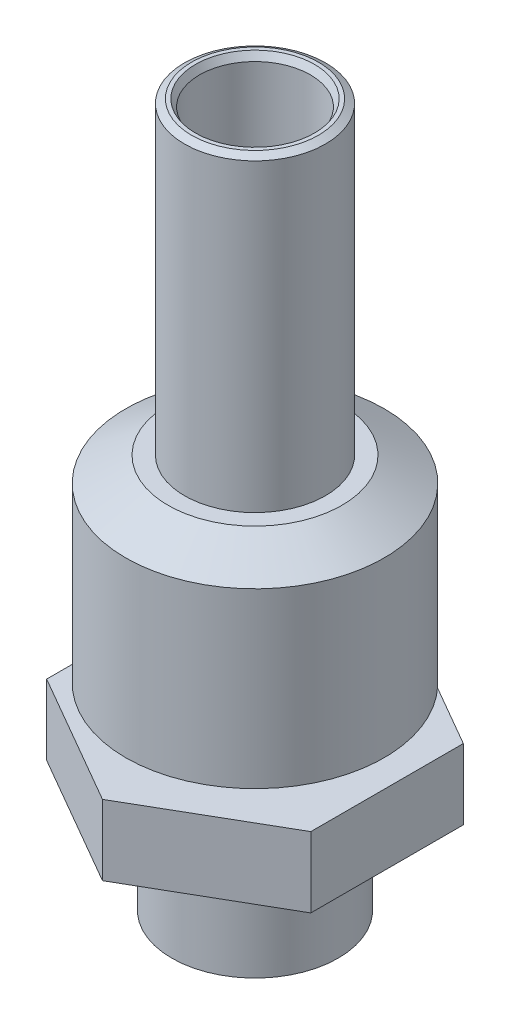
ISO-10303-21;
HEADER;
FILE_DESCRIPTION(('STEP AP214'),'2;1');
FILE_NAME('part.step','',(''),(''),'','','');
FILE_SCHEMA(('AUTOMOTIVE_DESIGN { 1 0 10303 214 1 1 1 1 }'));
ENDSEC;
DATA;
#1=APPLICATION_CONTEXT('core data for automotive mechanical design processes');
#2=APPLICATION_PROTOCOL_DEFINITION('international standard','automotive_design',2000,#1);
#3=PRODUCT_CONTEXT('',#1,'mechanical');
#4=PRODUCT('Part','Part','',(#3));
#5=PRODUCT_RELATED_PRODUCT_CATEGORY('part','',(#4));
#6=PRODUCT_DEFINITION_FORMATION('','',#4);
#7=PRODUCT_DEFINITION_CONTEXT('part definition',#1,'design');
#8=PRODUCT_DEFINITION('design','',#6,#7);
#9=PRODUCT_DEFINITION_SHAPE('','',#8);
#10=(LENGTH_UNIT() NAMED_UNIT(*) SI_UNIT(.MILLI.,.METRE.));
#11=(NAMED_UNIT(*) PLANE_ANGLE_UNIT() SI_UNIT($,.RADIAN.));
#12=(NAMED_UNIT(*) SI_UNIT($,.STERADIAN.) SOLID_ANGLE_UNIT());
#13=UNCERTAINTY_MEASURE_WITH_UNIT(LENGTH_MEASURE(1.E-05),#10,'distance_accuracy_value','');
#14=(GEOMETRIC_REPRESENTATION_CONTEXT(3) GLOBAL_UNCERTAINTY_ASSIGNED_CONTEXT((#13)) GLOBAL_UNIT_ASSIGNED_CONTEXT((#10,
#11,#12)) REPRESENTATION_CONTEXT('',''));
#15=CARTESIAN_POINT('',(0.,0.,0.));
#16=DIRECTION('',(0.,0.,1.));
#17=DIRECTION('',(1.,0.,0.));
#18=AXIS2_PLACEMENT_3D('',#15,#16,#17);
#19=CARTESIAN_POINT('',(4.7625,27.432,2.74963065701559));
#20=DIRECTION('',(-1.,0.,0.));
#21=DIRECTION('',(0.,0.,1.));
#22=AXIS2_PLACEMENT_3D('',#19,#20,#21);
#23=PLANE('',#22);
#24=DIRECTION('',(0.,0.,1.));
#25=VECTOR('',#24,1.);
#26=CARTESIAN_POINT('',(4.7625,5.762,2.74963065701559));
#27=LINE('',#26,#25);
#28=CARTESIAN_POINT('',(4.7625,5.762,-2.74963065701559));
#29=VERTEX_POINT('',#28);
#30=CARTESIAN_POINT('',(4.7625,5.762,2.74963065701559));
#31=VERTEX_POINT('',#30);
#32=EDGE_CURVE('E51',#29,#31,#27,.T.);
#33=ORIENTED_EDGE('',*,*,#32,.F.);
#34=DIRECTION('',(0.,-1.,0.));
#35=VECTOR('',#34,1.);
#36=CARTESIAN_POINT('',(4.7625,27.432,-2.74963065701559));
#37=LINE('',#36,#35);
#38=CARTESIAN_POINT('',(4.7625,8.302,-2.74963065701559));
#39=VERTEX_POINT('',#38);
#40=EDGE_CURVE('E119',#39,#29,#37,.T.);
#41=ORIENTED_EDGE('',*,*,#40,.F.);
#42=DIRECTION('',(0.,0.,1.));
#43=VECTOR('',#42,1.);
#44=CARTESIAN_POINT('',(4.7625,8.302,2.74963065701559));
#45=LINE('',#44,#43);
#46=CARTESIAN_POINT('',(4.7625,8.302,2.74963065701559));
#47=VERTEX_POINT('',#46);
#48=EDGE_CURVE('E110',#39,#47,#45,.T.);
#49=ORIENTED_EDGE('',*,*,#48,.T.);
#50=DIRECTION('',(0.,-1.,0.));
#51=VECTOR('',#50,1.);
#52=CARTESIAN_POINT('',(4.7625,27.432,2.74963065701559));
#53=LINE('',#52,#51);
#54=EDGE_CURVE('E106',#47,#31,#53,.T.);
#55=ORIENTED_EDGE('',*,*,#54,.T.);
#56=EDGE_LOOP('',(#33,#41,#49,#55));
#57=FACE_BOUND('',#56,.T.);
#58=ADVANCED_FACE('F37',(#57),#23,.F.);
#59=CARTESIAN_POINT('',(4.7625,27.432,-2.74963065701559));
#60=DIRECTION('',(-0.5,0.,0.866025403784439));
#61=DIRECTION('',(0.866025403784439,0.,0.5));
#62=AXIS2_PLACEMENT_3D('',#59,#60,#61);
#63=PLANE('',#62);
#64=DIRECTION('',(0.866025403784439,0.,0.5));
#65=VECTOR('',#64,1.);
#66=CARTESIAN_POINT('',(4.76249999999999,5.762,-2.7496306570156));
#67=LINE('',#66,#65);
#68=CARTESIAN_POINT('',(0.,5.762,-5.49926131403118));
#69=VERTEX_POINT('',#68);
#70=EDGE_CURVE('E154',#69,#29,#67,.T.);
#71=ORIENTED_EDGE('',*,*,#70,.F.);
#72=DIRECTION('',(0.,-1.,0.));
#73=VECTOR('',#72,1.);
#74=CARTESIAN_POINT('',(0.,27.432,-5.49926131403118));
#75=LINE('',#74,#73);
#76=CARTESIAN_POINT('',(0.,8.302,-5.49926131403118));
#77=VERTEX_POINT('',#76);
#78=EDGE_CURVE('E116',#77,#69,#75,.T.);
#79=ORIENTED_EDGE('',*,*,#78,.F.);
#80=DIRECTION('',(0.866025403784439,0.,0.5));
#81=VECTOR('',#80,1.);
#82=CARTESIAN_POINT('',(4.7625,8.302,-2.74963065701559));
#83=LINE('',#82,#81);
#84=EDGE_CURVE('E189',#77,#39,#83,.T.);
#85=ORIENTED_EDGE('',*,*,#84,.T.);
#86=ORIENTED_EDGE('',*,*,#40,.T.);
#87=EDGE_LOOP('',(#71,#79,#85,#86));
#88=FACE_BOUND('',#87,.T.);
#89=ADVANCED_FACE('F198',(#88),#63,.F.);
#90=CARTESIAN_POINT('',(0.,27.432,-5.49926131403118));
#91=DIRECTION('',(0.500000000000001,0.,0.866025403784438));
#92=DIRECTION('',(0.866025403784438,0.,-0.500000000000001));
#93=AXIS2_PLACEMENT_3D('',#90,#91,#92);
#94=PLANE('',#93);
#95=DIRECTION('',(0.866025403784438,0.,-0.500000000000001));
#96=VECTOR('',#95,1.);
#97=CARTESIAN_POINT('',(0.,5.762,-5.49926131403118));
#98=LINE('',#97,#96);
#99=CARTESIAN_POINT('',(-4.7625,5.762,-2.74963065701559));
#100=VERTEX_POINT('',#99);
#101=EDGE_CURVE('E152',#100,#69,#98,.T.);
#102=ORIENTED_EDGE('',*,*,#101,.F.);
#103=DIRECTION('',(0.,-1.,0.));
#104=VECTOR('',#103,1.);
#105=CARTESIAN_POINT('',(-4.7625,27.432,-2.74963065701559));
#106=LINE('',#105,#104);
#107=CARTESIAN_POINT('',(-4.7625,8.302,-2.74963065701559));
#108=VERTEX_POINT('',#107);
#109=EDGE_CURVE('E108',#108,#100,#106,.T.);
#110=ORIENTED_EDGE('',*,*,#109,.F.);
#111=DIRECTION('',(0.866025403784438,0.,-0.500000000000001));
#112=VECTOR('',#111,1.);
#113=CARTESIAN_POINT('',(0.,8.302,-5.49926131403118));
#114=LINE('',#113,#112);
#115=EDGE_CURVE('E186',#108,#77,#114,.T.);
#116=ORIENTED_EDGE('',*,*,#115,.T.);
#117=ORIENTED_EDGE('',*,*,#78,.T.);
#118=EDGE_LOOP('',(#102,#110,#116,#117));
#119=FACE_BOUND('',#118,.T.);
#120=ADVANCED_FACE('F201',(#119),#94,.F.);
#121=CARTESIAN_POINT('',(-4.7625,27.432,-2.74963065701559));
#122=DIRECTION('',(1.,0.,0.));
#123=DIRECTION('',(0.,0.,-1.));
#124=AXIS2_PLACEMENT_3D('',#121,#122,#123);
#125=PLANE('',#124);
#126=DIRECTION('',(0.,0.,-1.));
#127=VECTOR('',#126,1.);
#128=CARTESIAN_POINT('',(-4.7625,5.762,-2.74963065701559));
#129=LINE('',#128,#127);
#130=CARTESIAN_POINT('',(-4.7625,5.762,2.7496306570156));
#131=VERTEX_POINT('',#130);
#132=EDGE_CURVE('E101',#131,#100,#129,.T.);
#133=ORIENTED_EDGE('',*,*,#132,.F.);
#134=DIRECTION('',(0.,-1.,0.));
#135=VECTOR('',#134,1.);
#136=CARTESIAN_POINT('',(-4.7625,27.432,2.7496306570156));
#137=LINE('',#136,#135);
#138=CARTESIAN_POINT('',(-4.7625,8.302,2.7496306570156));
#139=VERTEX_POINT('',#138);
#140=EDGE_CURVE('E100',#139,#131,#137,.T.);
#141=ORIENTED_EDGE('',*,*,#140,.F.);
#142=DIRECTION('',(0.,0.,-1.));
#143=VECTOR('',#142,1.);
#144=CARTESIAN_POINT('',(-4.7625,8.302,-2.74963065701559));
#145=LINE('',#144,#143);
#146=EDGE_CURVE('E183',#139,#108,#145,.T.);
#147=ORIENTED_EDGE('',*,*,#146,.T.);
#148=ORIENTED_EDGE('',*,*,#109,.T.);
#149=EDGE_LOOP('',(#133,#141,#147,#148));
#150=FACE_BOUND('',#149,.T.);
#151=ADVANCED_FACE('F204',(#150),#125,.F.);
#152=CARTESIAN_POINT('',(-4.7625,27.432,2.7496306570156));
#153=DIRECTION('',(0.5,0.,-0.866025403784439));
#154=DIRECTION('',(-0.866025403784439,0.,-0.5));
#155=AXIS2_PLACEMENT_3D('',#152,#153,#154);
#156=PLANE('',#155);
#157=DIRECTION('',(-0.866025403784439,0.,-0.5));
#158=VECTOR('',#157,1.);
#159=CARTESIAN_POINT('',(-4.7625,5.762,2.74963065701559));
#160=LINE('',#159,#158);
#161=CARTESIAN_POINT('',(0.,5.762,5.49926131403119));
#162=VERTEX_POINT('',#161);
#163=EDGE_CURVE('E88',#162,#131,#160,.T.);
#164=ORIENTED_EDGE('',*,*,#163,.F.);
#165=DIRECTION('',(0.,-1.,0.));
#166=VECTOR('',#165,1.);
#167=CARTESIAN_POINT('',(0.,27.432,5.49926131403119));
#168=LINE('',#167,#166);
#169=CARTESIAN_POINT('',(0.,8.302,5.49926131403119));
#170=VERTEX_POINT('',#169);
#171=EDGE_CURVE('E98',#170,#162,#168,.T.);
#172=ORIENTED_EDGE('',*,*,#171,.F.);
#173=DIRECTION('',(-0.866025403784439,0.,-0.5));
#174=VECTOR('',#173,1.);
#175=CARTESIAN_POINT('',(-4.7625,8.302,2.7496306570156));
#176=LINE('',#175,#174);
#177=EDGE_CURVE('E59',#170,#139,#176,.T.);
#178=ORIENTED_EDGE('',*,*,#177,.T.);
#179=ORIENTED_EDGE('',*,*,#140,.T.);
#180=EDGE_LOOP('',(#164,#172,#178,#179));
#181=FACE_BOUND('',#180,.T.);
#182=ADVANCED_FACE('F97',(#181),#156,.F.);
#183=CARTESIAN_POINT('',(0.,27.432,5.49926131403119));
#184=DIRECTION('',(-0.5,0.,-0.866025403784438));
#185=DIRECTION('',(-0.866025403784438,0.,0.5));
#186=AXIS2_PLACEMENT_3D('',#183,#184,#185);
#187=PLANE('',#186);
#188=DIRECTION('',(-0.866025403784438,0.,0.5));
#189=VECTOR('',#188,1.);
#190=CARTESIAN_POINT('',(0.,5.762,5.49926131403119));
#191=LINE('',#190,#189);
#192=EDGE_CURVE('E11',#31,#162,#191,.T.);
#193=ORIENTED_EDGE('',*,*,#192,.F.);
#194=ORIENTED_EDGE('',*,*,#54,.F.);
#195=DIRECTION('',(-0.866025403784438,0.,0.5));
#196=VECTOR('',#195,1.);
#197=CARTESIAN_POINT('',(0.,8.302,5.49926131403119));
#198=LINE('',#197,#196);
#199=EDGE_CURVE('E105',#47,#170,#198,.T.);
#200=ORIENTED_EDGE('',*,*,#199,.T.);
#201=ORIENTED_EDGE('',*,*,#171,.T.);
#202=EDGE_LOOP('',(#193,#194,#200,#201));
#203=FACE_BOUND('',#202,.T.);
#204=ADVANCED_FACE('F104',(#203),#187,.F.);
#205=CARTESIAN_POINT('',(0.,1.39107264208463,0.));
#206=DIRECTION('',(0.,1.,0.));
#207=DIRECTION('',(0.,0.,1.));
#208=AXIS2_PLACEMENT_3D('',#205,#206,#207);
#209=CONICAL_SURFACE('',#208,0.,1.08210413623648);
#210=CARTESIAN_POINT('',(0.,1.92116035997955,0.));
#211=DIRECTION('',(0.,-1.,0.));
#212=DIRECTION('',(0.,0.,-1.));
#213=AXIS2_PLACEMENT_3D('',#210,#211,#212);
#214=CIRCLE('',#213,0.996949999999998);
#215=CARTESIAN_POINT('',(0.,1.92116035997955,0.996949999999998));
#216=VERTEX_POINT('',#215);
#217=EDGE_CURVE('E158',#216,#216,#214,.T.);
#218=CARTESIAN_POINT('',(0.,1.48412179262539,0.));
#219=DIRECTION('',(0.,1.,0.));
#220=DIRECTION('',(0.,0.,1.));
#221=AXIS2_PLACEMENT_3D('',#218,#219,#220);
#222=CIRCLE('',#221,0.175);
#223=CARTESIAN_POINT('',(0.,1.48412179262539,0.175));
#224=VERTEX_POINT('',#223);
#225=EDGE_CURVE('E102',#224,#224,#222,.T.);
#226=CARTESIAN_POINT('',(0.,1.92116035997955,0.996949999999998));
#227=CARTESIAN_POINT('',(0.,1.91660787490294,0.988388020833332));
#228=CARTESIAN_POINT('',(0.,1.91205538982634,0.979826041666665));
#229=CARTESIAN_POINT('',(0.,1.90295041967312,0.962702083333332));
#230=CARTESIAN_POINT('',(0.,1.89839793459652,0.954140104166665));
#231=CARTESIAN_POINT('',(0.,1.88929296444331,0.937016145833332));
#232=CARTESIAN_POINT('',(0.,1.8847404793667,0.928454166666665));
#233=CARTESIAN_POINT('',(0.,1.87563550921349,0.911330208333332));
#234=CARTESIAN_POINT('',(0.,1.87108302413688,0.902768229166665));
#235=CARTESIAN_POINT('',(0.,1.86197805398367,0.885644270833332));
#236=CARTESIAN_POINT('',(0.,1.85742556890707,0.877082291666665));
#237=CARTESIAN_POINT('',(0.,1.84832059875385,0.859958333333332));
#238=CARTESIAN_POINT('',(0.,1.84376811367725,0.851396354166665));
#239=CARTESIAN_POINT('',(0.,1.83466314352404,0.834272395833332));
#240=CARTESIAN_POINT('',(0.,1.83011065844743,0.825710416666665));
#241=CARTESIAN_POINT('',(0.,1.82100568829422,0.808586458333332));
#242=CARTESIAN_POINT('',(0.,1.81645320321761,0.800024479166665));
#243=CARTESIAN_POINT('',(0.,1.8073482330644,0.782900520833332));
#244=CARTESIAN_POINT('',(0.,1.8027957479878,0.774338541666665));
#245=CARTESIAN_POINT('',(0.,1.79369077783458,0.757214583333332));
#246=CARTESIAN_POINT('',(0.,1.78913829275798,0.748652604166666));
#247=CARTESIAN_POINT('',(0.,1.78003332260477,0.731528645833332));
#248=CARTESIAN_POINT('',(0.,1.77548083752816,0.722966666666666));
#249=CARTESIAN_POINT('',(0.,1.76637586737495,0.705842708333332));
#250=CARTESIAN_POINT('',(0.,1.76182338229834,0.697280729166666));
#251=CARTESIAN_POINT('',(0.,1.75271841214513,0.680156770833332));
#252=CARTESIAN_POINT('',(0.,1.74816592706853,0.671594791666666));
#253=CARTESIAN_POINT('',(0.,1.73906095691532,0.654470833333332));
#254=CARTESIAN_POINT('',(0.,1.73450847183871,0.645908854166666));
#255=CARTESIAN_POINT('',(0.,1.7254035016855,0.628784895833332));
#256=CARTESIAN_POINT('',(0.,1.72085101660889,0.620222916666666));
#257=CARTESIAN_POINT('',(0.,1.71174604645568,0.603098958333332));
#258=CARTESIAN_POINT('',(0.,1.70719356137907,0.594536979166666));
#259=CARTESIAN_POINT('',(0.,1.69808859122586,0.577413020833332));
#260=CARTESIAN_POINT('',(0.,1.69353610614926,0.568851041666666));
#261=CARTESIAN_POINT('',(0.,1.68443113599605,0.551727083333333));
#262=CARTESIAN_POINT('',(0.,1.67987865091944,0.543165104166666));
#263=CARTESIAN_POINT('',(0.,1.67077368076623,0.526041145833333));
#264=CARTESIAN_POINT('',(0.,1.66622119568962,0.517479166666666));
#265=CARTESIAN_POINT('',(0.,1.65711622553641,0.500355208333333));
#266=CARTESIAN_POINT('',(0.,1.65256374045981,0.491793229166666));
#267=CARTESIAN_POINT('',(0.,1.64345877030659,0.474669270833333));
#268=CARTESIAN_POINT('',(0.,1.63890628522999,0.466107291666666));
#269=CARTESIAN_POINT('',(0.,1.62980131507678,0.448983333333333));
#270=CARTESIAN_POINT('',(0.,1.62524883000017,0.440421354166666));
#271=CARTESIAN_POINT('',(0.,1.61614385984696,0.423297395833333));
#272=CARTESIAN_POINT('',(0.,1.61159137477035,0.414735416666666));
#273=CARTESIAN_POINT('',(0.,1.60248640461714,0.397611458333333));
#274=CARTESIAN_POINT('',(0.,1.59793391954054,0.389049479166666));
#275=CARTESIAN_POINT('',(0.,1.58882894938732,0.371925520833333));
#276=CARTESIAN_POINT('',(0.,1.58427646431072,0.363363541666666));
#277=CARTESIAN_POINT('',(0.,1.57517149415751,0.346239583333333));
#278=CARTESIAN_POINT('',(0.,1.5706190090809,0.337677604166666));
#279=CARTESIAN_POINT('',(0.,1.56151403892769,0.320553645833333));
#280=CARTESIAN_POINT('',(0.,1.55696155385108,0.311991666666666));
#281=CARTESIAN_POINT('',(0.,1.54785658369787,0.294867708333333));
#282=CARTESIAN_POINT('',(0.,1.54330409862127,0.286305729166666));
#283=CARTESIAN_POINT('',(0.,1.53419912846806,0.269181770833333));
#284=CARTESIAN_POINT('',(0.,1.52964664339145,0.260619791666666));
#285=CARTESIAN_POINT('',(0.,1.52054167323824,0.243495833333333));
#286=CARTESIAN_POINT('',(0.,1.51598918816163,0.234933854166667));
#287=CARTESIAN_POINT('',(0.,1.50688421800842,0.217809895833333));
#288=CARTESIAN_POINT('',(0.,1.50233173293181,0.209247916666667));
#289=CARTESIAN_POINT('',(0.,1.4932267627786,0.192123958333333));
#290=CARTESIAN_POINT('',(0.,1.488674277702,0.183561979166667));
#291=CARTESIAN_POINT('',(0.,1.48412179262539,0.175));
#292=B_SPLINE_CURVE_WITH_KNOTS('',3,(#226,#227,#228,#229,#230,#231,#232,#233,#234,#235,#236,
#237,#238,#239,#240,#241,#242,#243,#244,#245,#246,#247,#248,#249,#250,#251,#252,#253,#254,#255,
#256,#257,#258,#259,#260,#261,#262,#263,#264,#265,#266,#267,#268,#269,#270,#271,#272,#273,#274,
#275,#276,#277,#278,#279,#280,#281,#282,#283,#284,#285,#286,#287,#288,#289,#290,#291),
.UNSPECIFIED.,.F.,.F.,(4,2,2,2,2,2,2,2,2,2,2,2,2,2,2,2,2,2,2,2,2,2,2,2,2,2,2,2,2,2,2,2,4),(0.,
0.0290911235363705,0.0581822470727408,0.0872733706091116,0.116364494145482,0.145455617681852,
0.174546741218223,0.203637864754593,0.232728988290964,0.261820111827334,0.290911235363705,
0.320002358900075,0.349093482436446,0.378184605972816,0.407275729509187,0.436366853045557,
0.465457976581928,0.494549100118298,0.523640223654669,0.552731347191039,0.58182247072741,
0.61091359426378,0.640004717800151,0.669095841336521,0.698186964872892,0.727278088409262,
0.756369211945633,0.785460335482003,0.814551459018374,0.843642582554744,0.872733706091115,
0.901824829627485,0.930915953163856),.UNSPECIFIED.);
#293=EDGE_CURVE('BSEAM265',#216,#224,#292,.T.);
#294=ORIENTED_EDGE('',*,*,#217,.F.);
#295=ORIENTED_EDGE('',*,*,#225,.F.);
#296=ORIENTED_EDGE('',*,*,#293,.T.);
#297=ORIENTED_EDGE('',*,*,#293,.F.);
#298=EDGE_LOOP('',(#294,#296,#295,#297));
#299=FACE_BOUND('',#298,.T.);
#300=ADVANCED_FACE('F265',(#299),#209,.F.);
#301=CARTESIAN_POINT('',(0.,8.302,0.));
#302=DIRECTION('',(0.,-1.,0.));
#303=DIRECTION('',(0.,0.,-1.));
#304=AXIS2_PLACEMENT_3D('',#301,#302,#303);
#305=PLANE('',#304);
#306=CARTESIAN_POINT('',(0.,8.302,0.));
#307=DIRECTION('',(0.,-1.,0.));
#308=DIRECTION('',(0.,0.,-1.));
#309=AXIS2_PLACEMENT_3D('',#306,#307,#308);
#310=CIRCLE('',#309,3.1369);
#311=CARTESIAN_POINT('',(0.,8.302,-3.1369));
#312=VERTEX_POINT('',#311);
#313=EDGE_CURVE('E179',#312,#312,#310,.T.);
#314=ORIENTED_EDGE('',*,*,#313,.T.);
#315=EDGE_LOOP('',(#314));
#316=FACE_BOUND('',#315,.T.);
#317=ORIENTED_EDGE('',*,*,#84,.F.);
#318=ORIENTED_EDGE('',*,*,#115,.F.);
#319=ORIENTED_EDGE('',*,*,#146,.F.);
#320=ORIENTED_EDGE('',*,*,#177,.F.);
#321=ORIENTED_EDGE('',*,*,#199,.F.);
#322=ORIENTED_EDGE('',*,*,#48,.F.);
#323=EDGE_LOOP('',(#317,#318,#319,#320,#321,#322));
#324=FACE_BOUND('',#323,.T.);
#325=ADVANCED_FACE('F194',(#316,#324),#305,.F.);
#326=CARTESIAN_POINT('',(0.,9.181881810245,0.));
#327=DIRECTION('',(0.,1.,0.));
#328=DIRECTION('',(0.,0.,1.));
#329=AXIS2_PLACEMENT_3D('',#326,#327,#328);
#330=CONICAL_SURFACE('',#329,4.6609,1.04719755119659);
#331=ORIENTED_EDGE('',*,*,#313,.F.);
#332=EDGE_LOOP('',(#331));
#333=FACE_BOUND('',#332,.T.);
#334=CARTESIAN_POINT('',(0.,9.181881810245,0.));
#335=DIRECTION('',(0.,-1.,0.));
#336=DIRECTION('',(0.,0.,-1.));
#337=AXIS2_PLACEMENT_3D('',#334,#335,#336);
#338=CIRCLE('',#337,4.6609);
#339=CARTESIAN_POINT('',(0.,9.181881810245,-4.6609));
#340=VERTEX_POINT('',#339);
#341=EDGE_CURVE('E176',#340,#340,#338,.T.);
#342=ORIENTED_EDGE('',*,*,#341,.T.);
#343=EDGE_LOOP('',(#342));
#344=FACE_BOUND('',#343,.T.);
#345=ADVANCED_FACE('F258',(#333,#344),#330,.T.);
#346=CARTESIAN_POINT('',(0.,0.,0.));
#347=DIRECTION('',(0.,-1.,0.));
#348=DIRECTION('',(0.,0.,-1.));
#349=AXIS2_PLACEMENT_3D('',#346,#347,#348);
#350=CYLINDRICAL_SURFACE('',#349,4.6609);
#351=ORIENTED_EDGE('',*,*,#341,.F.);
#352=EDGE_LOOP('',(#351));
#353=FACE_BOUND('',#352,.T.);
#354=CARTESIAN_POINT('',(0.,15.422118189755,0.));
#355=DIRECTION('',(0.,-1.,0.));
#356=DIRECTION('',(0.,0.,-1.));
#357=AXIS2_PLACEMENT_3D('',#354,#355,#356);
#358=CIRCLE('',#357,4.6609);
#359=CARTESIAN_POINT('',(0.,15.422118189755,-4.6609));
#360=VERTEX_POINT('',#359);
#361=EDGE_CURVE('E173',#360,#360,#358,.T.);
#362=ORIENTED_EDGE('',*,*,#361,.T.);
#363=EDGE_LOOP('',(#362));
#364=FACE_BOUND('',#363,.T.);
#365=ADVANCED_FACE('F250',(#353,#364),#350,.T.);
#366=CARTESIAN_POINT('',(0.,16.302,0.));
#367=DIRECTION('',(0.,-1.,0.));
#368=DIRECTION('',(0.,0.,-1.));
#369=AXIS2_PLACEMENT_3D('',#366,#367,#368);
#370=CONICAL_SURFACE('',#369,3.1369,1.0471975511966);
#371=ORIENTED_EDGE('',*,*,#361,.F.);
#372=EDGE_LOOP('',(#371));
#373=FACE_BOUND('',#372,.T.);
#374=CARTESIAN_POINT('',(0.,16.302,0.));
#375=DIRECTION('',(0.,-1.,0.));
#376=DIRECTION('',(0.,0.,-1.));
#377=AXIS2_PLACEMENT_3D('',#374,#375,#376);
#378=CIRCLE('',#377,3.1369);
#379=CARTESIAN_POINT('',(0.,16.302,-3.1369));
#380=VERTEX_POINT('',#379);
#381=EDGE_CURVE('E170',#380,#380,#378,.T.);
#382=ORIENTED_EDGE('',*,*,#381,.T.);
#383=EDGE_LOOP('',(#382));
#384=FACE_BOUND('',#383,.T.);
#385=ADVANCED_FACE('F244',(#373,#384),#370,.T.);
#386=CARTESIAN_POINT('',(0.,16.302,0.));
#387=DIRECTION('',(0.,-1.,0.));
#388=DIRECTION('',(0.,0.,-1.));
#389=AXIS2_PLACEMENT_3D('',#386,#387,#388);
#390=PLANE('',#389);
#391=ORIENTED_EDGE('',*,*,#381,.F.);
#392=EDGE_LOOP('',(#391));
#393=FACE_BOUND('',#392,.T.);
#394=CARTESIAN_POINT('',(0.,16.302,0.));
#395=DIRECTION('',(0.,-1.,0.));
#396=DIRECTION('',(0.,0.,-1.));
#397=AXIS2_PLACEMENT_3D('',#394,#395,#396);
#398=CIRCLE('',#397,2.54);
#399=CARTESIAN_POINT('',(0.,16.302,-2.54));
#400=VERTEX_POINT('',#399);
#401=EDGE_CURVE('E167',#400,#400,#398,.T.);
#402=ORIENTED_EDGE('',*,*,#401,.T.);
#403=EDGE_LOOP('',(#402));
#404=FACE_BOUND('',#403,.T.);
#405=ADVANCED_FACE('F239',(#393,#404),#390,.F.);
#406=CARTESIAN_POINT('',(0.,0.,0.));
#407=DIRECTION('',(0.,-1.,0.));
#408=DIRECTION('',(0.,0.,-1.));
#409=AXIS2_PLACEMENT_3D('',#406,#407,#408);
#410=CYLINDRICAL_SURFACE('',#409,2.54);
#411=CARTESIAN_POINT('',(0.,27.2853530316258,0.));
#412=DIRECTION('',(0.,1.,0.));
#413=DIRECTION('',(0.,0.,1.));
#414=AXIS2_PLACEMENT_3D('',#411,#412,#413);
#415=CIRCLE('',#414,2.54);
#416=CARTESIAN_POINT('',(0.,27.2853530316258,2.54));
#417=VERTEX_POINT('',#416);
#418=EDGE_CURVE('E123',#417,#417,#415,.F.);
#419=ORIENTED_EDGE('',*,*,#418,.T.);
#420=EDGE_LOOP('',(#419));
#421=FACE_BOUND('',#420,.T.);
#422=ORIENTED_EDGE('',*,*,#401,.F.);
#423=EDGE_LOOP('',(#422));
#424=FACE_BOUND('',#423,.T.);
#425=ADVANCED_FACE('F235',(#421,#424),#410,.T.);
#426=CARTESIAN_POINT('',(0.,27.432,0.));
#427=DIRECTION('',(0.,1.,0.));
#428=DIRECTION('',(0.,0.,1.));
#429=AXIS2_PLACEMENT_3D('',#426,#427,#428);
#430=PLANE('',#429);
#431=CARTESIAN_POINT('',(0.,27.432,0.));
#432=DIRECTION('',(0.,1.,0.));
#433=DIRECTION('',(0.,0.,1.));
#434=AXIS2_PLACEMENT_3D('',#431,#432,#433);
#435=CIRCLE('',#434,2.28600000000001);
#436=CARTESIAN_POINT('',(0.,27.432,2.28600000000001));
#437=VERTEX_POINT('',#436);
#438=EDGE_CURVE('E129',#437,#437,#435,.T.);
#439=ORIENTED_EDGE('',*,*,#438,.T.);
#440=EDGE_LOOP('',(#439));
#441=FACE_BOUND('',#440,.T.);
#442=CARTESIAN_POINT('',(0.,27.432,0.));
#443=DIRECTION('',(0.,1.,0.));
#444=DIRECTION('',(0.,0.,1.));
#445=AXIS2_PLACEMENT_3D('',#442,#443,#444);
#446=CIRCLE('',#445,2.14664696837416);
#447=CARTESIAN_POINT('',(0.,27.432,2.14664696837416));
#448=VERTEX_POINT('',#447);
#449=EDGE_CURVE('E126',#448,#448,#446,.F.);
#450=ORIENTED_EDGE('',*,*,#449,.T.);
#451=EDGE_LOOP('',(#450));
#452=FACE_BOUND('',#451,.T.);
#453=ADVANCED_FACE('F238',(#441,#452),#430,.T.);
#454=CARTESIAN_POINT('',(0.,0.,0.));
#455=DIRECTION('',(0.,-1.,0.));
#456=DIRECTION('',(0.,0.,-1.));
#457=AXIS2_PLACEMENT_3D('',#454,#455,#456);
#458=CYLINDRICAL_SURFACE('',#457,2.);
#459=CARTESIAN_POINT('',(0.,27.178,0.));
#460=DIRECTION('',(0.,1.,0.));
#461=DIRECTION('',(0.,0.,1.));
#462=AXIS2_PLACEMENT_3D('',#459,#460,#461);
#463=CIRCLE('',#462,2.);
#464=CARTESIAN_POINT('',(0.,27.178,2.));
#465=VERTEX_POINT('',#464);
#466=EDGE_CURVE('E45',#465,#465,#463,.T.);
#467=ORIENTED_EDGE('',*,*,#466,.T.);
#468=EDGE_LOOP('',(#467));
#469=FACE_BOUND('',#468,.T.);
#470=CARTESIAN_POINT('',(0.,21.082,0.));
#471=DIRECTION('',(0.,-1.,0.));
#472=DIRECTION('',(0.,0.,-1.));
#473=AXIS2_PLACEMENT_3D('',#470,#471,#472);
#474=CIRCLE('',#473,2.);
#475=CARTESIAN_POINT('',(0.,21.082,-2.));
#476=VERTEX_POINT('',#475);
#477=EDGE_CURVE('E164',#476,#476,#474,.T.);
#478=ORIENTED_EDGE('',*,*,#477,.T.);
#479=EDGE_LOOP('',(#478));
#480=FACE_BOUND('',#479,.T.);
#481=ADVANCED_FACE('F269',(#469,#480),#458,.F.);
#482=CARTESIAN_POINT('',(0.,21.082,0.));
#483=DIRECTION('',(0.,1.,0.));
#484=DIRECTION('',(0.,0.,1.));
#485=AXIS2_PLACEMENT_3D('',#482,#483,#484);
#486=PLANE('',#485);
#487=CARTESIAN_POINT('',(0.,21.082,0.));
#488=DIRECTION('',(0.,-1.,0.));
#489=DIRECTION('',(0.,0.,-1.));
#490=AXIS2_PLACEMENT_3D('',#487,#488,#489);
#491=CIRCLE('',#490,0.99695);
#492=CARTESIAN_POINT('',(0.,21.082,-0.99695));
#493=VERTEX_POINT('',#492);
#494=EDGE_CURVE('E161',#493,#493,#491,.T.);
#495=ORIENTED_EDGE('',*,*,#494,.T.);
#496=EDGE_LOOP('',(#495));
#497=FACE_BOUND('',#496,.T.);
#498=ORIENTED_EDGE('',*,*,#477,.F.);
#499=EDGE_LOOP('',(#498));
#500=FACE_BOUND('',#499,.T.);
#501=ADVANCED_FACE('F228',(#497,#500),#486,.T.);
#502=CARTESIAN_POINT('',(0.,0.,0.));
#503=DIRECTION('',(0.,-1.,0.));
#504=DIRECTION('',(0.,0.,-1.));
#505=AXIS2_PLACEMENT_3D('',#502,#503,#504);
#506=CYLINDRICAL_SURFACE('',#505,0.996949999999999);
#507=ORIENTED_EDGE('',*,*,#217,.T.);
#508=EDGE_LOOP('',(#507));
#509=FACE_BOUND('',#508,.T.);
#510=ORIENTED_EDGE('',*,*,#494,.F.);
#511=EDGE_LOOP('',(#510));
#512=FACE_BOUND('',#511,.T.);
#513=ADVANCED_FACE('F221',(#509,#512),#506,.F.);
#514=CARTESIAN_POINT('',(0.,27.2853530316258,0.));
#515=DIRECTION('',(0.,-1.,0.));
#516=DIRECTION('',(0.,0.,-1.));
#517=AXIS2_PLACEMENT_3D('',#514,#515,#516);
#518=CONICAL_SURFACE('',#517,2.54,1.0471975511966);
#519=ORIENTED_EDGE('',*,*,#438,.F.);
#520=EDGE_LOOP('',(#519));
#521=FACE_BOUND('',#520,.T.);
#522=ORIENTED_EDGE('',*,*,#418,.F.);
#523=EDGE_LOOP('',(#522));
#524=FACE_BOUND('',#523,.T.);
#525=ADVANCED_FACE('F219',(#521,#524),#518,.T.);
#526=CARTESIAN_POINT('',(0.,27.432,0.));
#527=DIRECTION('',(0.,1.,0.));
#528=DIRECTION('',(0.,0.,1.));
#529=AXIS2_PLACEMENT_3D('',#526,#527,#528);
#530=CONICAL_SURFACE('',#529,2.14664696837416,0.523598775598291);
#531=ORIENTED_EDGE('',*,*,#466,.F.);
#532=EDGE_LOOP('',(#531));
#533=FACE_BOUND('',#532,.T.);
#534=ORIENTED_EDGE('',*,*,#449,.F.);
#535=EDGE_LOOP('',(#534));
#536=FACE_BOUND('',#535,.T.);
#537=ADVANCED_FACE('F39',(#533,#536),#530,.F.);
#538=CARTESIAN_POINT('',(-3.,5.762,0.));
#539=DIRECTION('',(0.,-1.,0.));
#540=DIRECTION('',(1.,0.,0.));
#541=AXIS2_PLACEMENT_3D('',#538,#539,#540);
#542=PLANE('',#541);
#543=CARTESIAN_POINT('',(0.,5.762,0.));
#544=DIRECTION('',(0.,-1.,0.));
#545=DIRECTION('',(1.,0.,0.));
#546=AXIS2_PLACEMENT_3D('',#543,#544,#545);
#547=CIRCLE('',#546,3.);
#548=CARTESIAN_POINT('',(3.,5.762,0.));
#549=VERTEX_POINT('',#548);
#550=EDGE_CURVE('E464',#549,#549,#547,.T.);
#551=ORIENTED_EDGE('',*,*,#550,.F.);
#552=EDGE_LOOP('',(#551));
#553=FACE_BOUND('',#552,.T.);
#554=ORIENTED_EDGE('',*,*,#32,.T.);
#555=ORIENTED_EDGE('',*,*,#192,.T.);
#556=ORIENTED_EDGE('',*,*,#163,.T.);
#557=ORIENTED_EDGE('',*,*,#132,.T.);
#558=ORIENTED_EDGE('',*,*,#101,.T.);
#559=ORIENTED_EDGE('',*,*,#70,.T.);
#560=EDGE_LOOP('',(#554,#555,#556,#557,#558,#559));
#561=FACE_BOUND('',#560,.T.);
#562=ADVANCED_FACE('F87',(#553,#561),#542,.T.);
#563=CARTESIAN_POINT('',(0.,0.,0.));
#564=DIRECTION('',(0.,-1.,0.));
#565=DIRECTION('',(1.,0.,0.));
#566=AXIS2_PLACEMENT_3D('',#563,#564,#565);
#567=CYLINDRICAL_SURFACE('',#566,0.175);
#568=CARTESIAN_POINT('',(0.,0.762,0.));
#569=DIRECTION('',(0.,-1.,0.));
#570=DIRECTION('',(1.,0.,0.));
#571=AXIS2_PLACEMENT_3D('',#568,#569,#570);
#572=CIRCLE('',#571,0.175);
#573=CARTESIAN_POINT('',(0.175,0.762,0.));
#574=VERTEX_POINT('',#573);
#575=EDGE_CURVE('E135',#574,#574,#572,.T.);
#576=ORIENTED_EDGE('',*,*,#575,.T.);
#577=EDGE_LOOP('',(#576));
#578=FACE_BOUND('',#577,.T.);
#579=ORIENTED_EDGE('',*,*,#225,.T.);
#580=EDGE_LOOP('',(#579));
#581=FACE_BOUND('',#580,.T.);
#582=ADVANCED_FACE('F282',(#578,#581),#567,.F.);
#583=CARTESIAN_POINT('',(-0.175,0.762,0.));
#584=DIRECTION('',(0.,-1.,0.));
#585=DIRECTION('',(1.,0.,0.));
#586=AXIS2_PLACEMENT_3D('',#583,#584,#585);
#587=PLANE('',#586);
#588=CARTESIAN_POINT('',(0.,0.762,0.));
#589=DIRECTION('',(0.,-1.,0.));
#590=DIRECTION('',(1.,0.,0.));
#591=AXIS2_PLACEMENT_3D('',#588,#589,#590);
#592=CIRCLE('',#591,0.5);
#593=CARTESIAN_POINT('',(-0.5,0.762,0.));
#594=VERTEX_POINT('',#593);
#595=EDGE_CURVE('E140',#594,#594,#592,.T.);
#596=ORIENTED_EDGE('',*,*,#595,.T.);
#597=EDGE_LOOP('',(#596));
#598=FACE_BOUND('',#597,.T.);
#599=ORIENTED_EDGE('',*,*,#575,.F.);
#600=EDGE_LOOP('',(#599));
#601=FACE_BOUND('',#600,.T.);
#602=ADVANCED_FACE('F429',(#598,#601),#587,.T.);
#603=CARTESIAN_POINT('',(0.,0.762,0.));
#604=DIRECTION('',(0.,1.,0.));
#605=DIRECTION('',(-1.,0.,0.));
#606=AXIS2_PLACEMENT_3D('',#603,#604,#605);
#607=CONICAL_SURFACE('',#606,0.5,1.08210413623643);
#608=CARTESIAN_POINT('',(0.,2.09127357915389,0.));
#609=DIRECTION('',(0.,-1.,0.));
#610=DIRECTION('',(1.,0.,0.));
#611=AXIS2_PLACEMENT_3D('',#608,#609,#610);
#612=CIRCLE('',#611,3.);
#613=CARTESIAN_POINT('',(-3.,2.09127357915389,0.));
#614=VERTEX_POINT('',#613);
#615=EDGE_CURVE('E147',#614,#614,#612,.T.);
#616=CARTESIAN_POINT('',(-3.,2.09127357915389,0.));
#617=CARTESIAN_POINT('',(-2.97395833333333,2.07742697937103,0.));
#618=CARTESIAN_POINT('',(-2.94791666666667,2.06358037958818,0.));
#619=CARTESIAN_POINT('',(-2.89583333333333,2.03588718002247,0.));
#620=CARTESIAN_POINT('',(-2.86979166666667,2.02204058023962,0.));
#621=CARTESIAN_POINT('',(-2.81770833333333,1.99434738067392,0.));
#622=CARTESIAN_POINT('',(-2.79166666666667,1.98050078089106,0.));
#623=CARTESIAN_POINT('',(-2.73958333333333,1.95280758132536,0.));
#624=CARTESIAN_POINT('',(-2.71354166666667,1.9389609815425,0.));
#625=CARTESIAN_POINT('',(-2.66145833333333,1.9112677819768,0.));
#626=CARTESIAN_POINT('',(-2.63541666666667,1.89742118219394,0.));
#627=CARTESIAN_POINT('',(-2.58333333333333,1.86972798262824,0.));
#628=CARTESIAN_POINT('',(-2.55729166666667,1.85588138284539,0.));
#629=CARTESIAN_POINT('',(-2.50520833333333,1.82818818327968,0.));
#630=CARTESIAN_POINT('',(-2.47916666666667,1.81434158349683,0.));
#631=CARTESIAN_POINT('',(-2.42708333333333,1.78664838393112,0.));
#632=CARTESIAN_POINT('',(-2.40104166666667,1.77280178414827,0.));
#633=CARTESIAN_POINT('',(-2.34895833333333,1.74510858458256,0.));
#634=CARTESIAN_POINT('',(-2.32291666666667,1.73126198479971,0.));
#635=CARTESIAN_POINT('',(-2.27083333333333,1.703568785234,0.));
#636=CARTESIAN_POINT('',(-2.24479166666667,1.68972218545115,0.));
#637=CARTESIAN_POINT('',(-2.19270833333333,1.66202898588544,0.));
#638=CARTESIAN_POINT('',(-2.16666666666667,1.64818238610259,0.));
#639=CARTESIAN_POINT('',(-2.11458333333333,1.62048918653688,0.));
#640=CARTESIAN_POINT('',(-2.08854166666667,1.60664258675403,0.));
#641=CARTESIAN_POINT('',(-2.03645833333333,1.57894938718833,0.));
#642=CARTESIAN_POINT('',(-2.01041666666667,1.56510278740547,0.));
#643=CARTESIAN_POINT('',(-1.95833333333333,1.53740958783977,0.));
#644=CARTESIAN_POINT('',(-1.93229166666667,1.52356298805691,0.));
#645=CARTESIAN_POINT('',(-1.88020833333333,1.49586978849121,0.));
#646=CARTESIAN_POINT('',(-1.85416666666667,1.48202318870836,0.));
#647=CARTESIAN_POINT('',(-1.80208333333333,1.45432998914265,0.));
#648=CARTESIAN_POINT('',(-1.77604166666667,1.4404833893598,0.));
#649=CARTESIAN_POINT('',(-1.72395833333333,1.41279018979409,0.));
#650=CARTESIAN_POINT('',(-1.69791666666667,1.39894359001124,0.));
#651=CARTESIAN_POINT('',(-1.64583333333333,1.37125039044553,0.));
#652=CARTESIAN_POINT('',(-1.61979166666667,1.35740379066268,0.));
#653=CARTESIAN_POINT('',(-1.56770833333333,1.32971059109697,0.));
#654=CARTESIAN_POINT('',(-1.54166666666667,1.31586399131412,0.));
#655=CARTESIAN_POINT('',(-1.48958333333333,1.28817079174841,0.));
#656=CARTESIAN_POINT('',(-1.46354166666667,1.27432419196556,0.));
#657=CARTESIAN_POINT('',(-1.41145833333333,1.24663099239985,0.));
#658=CARTESIAN_POINT('',(-1.38541666666667,1.232784392617,0.));
#659=CARTESIAN_POINT('',(-1.33333333333333,1.2050911930513,0.));
#660=CARTESIAN_POINT('',(-1.30729166666667,1.19124459326844,0.));
#661=CARTESIAN_POINT('',(-1.25520833333333,1.16355139370274,0.));
#662=CARTESIAN_POINT('',(-1.22916666666667,1.14970479391988,0.));
#663=CARTESIAN_POINT('',(-1.17708333333333,1.12201159435418,0.));
#664=CARTESIAN_POINT('',(-1.15104166666667,1.10816499457132,0.));
#665=CARTESIAN_POINT('',(-1.09895833333333,1.08047179500562,0.));
#666=CARTESIAN_POINT('',(-1.07291666666667,1.06662519522277,0.));
#667=CARTESIAN_POINT('',(-1.02083333333333,1.03893199565706,0.));
#668=CARTESIAN_POINT('',(-0.994791666666667,1.02508539587421,0.));
#669=CARTESIAN_POINT('',(-0.942708333333333,0.9973921963085,0.));
#670=CARTESIAN_POINT('',(-0.916666666666667,0.983545596525648,0.));
#671=CARTESIAN_POINT('',(-0.864583333333333,0.955852396959942,0.));
#672=CARTESIAN_POINT('',(-0.838541666666667,0.942005797177089,0.));
#673=CARTESIAN_POINT('',(-0.786458333333333,0.914312597611383,0.));
#674=CARTESIAN_POINT('',(-0.760416666666667,0.90046599782853,0.));
#675=CARTESIAN_POINT('',(-0.708333333333333,0.872772798262824,0.));
#676=CARTESIAN_POINT('',(-0.682291666666667,0.858926198479971,0.));
#677=CARTESIAN_POINT('',(-0.630208333333333,0.831232998914265,0.));
#678=CARTESIAN_POINT('',(-0.604166666666667,0.817386399131412,0.));
#679=CARTESIAN_POINT('',(-0.552083333333333,0.789693199565706,0.));
#680=CARTESIAN_POINT('',(-0.526041666666667,0.775846599782853,0.));
#681=CARTESIAN_POINT('',(-0.5,0.762,0.));
#682=B_SPLINE_CURVE_WITH_KNOTS('',3,(#616,#617,#618,#619,#620,#621,#622,#623,#624,#625,#626,
#627,#628,#629,#630,#631,#632,#633,#634,#635,#636,#637,#638,#639,#640,#641,#642,#643,#644,#645,
#646,#647,#648,#649,#650,#651,#652,#653,#654,#655,#656,#657,#658,#659,#660,#661,#662,#663,#664,
#665,#666,#667,#668,#669,#670,#671,#672,#673,#674,#675,#676,#677,#678,#679,#680,#681),
.UNSPECIFIED.,.F.,.F.,(4,2,2,2,2,2,2,2,2,2,2,2,2,2,2,2,2,2,2,2,2,2,2,2,2,2,2,2,2,2,2,2,4),(0.,
0.0884820352100836,0.176964070420168,0.265446105630252,0.353928140840336,0.44241017605042,
0.530892211260503,0.619374246470587,0.707856281680671,0.796338316890755,0.884820352100839,
0.973302387310923,1.06178442252101,1.15026645773109,1.23874849294117,1.32723052815126,
1.41571256336134,1.50419459857143,1.59267663378151,1.68115866899159,1.76964070420168,
1.85812273941176,1.94660477462185,2.03508680983193,2.12356884504201,2.2120508802521,
2.30053291546218,2.38901495067227,2.47749698588235,2.56597902109243,2.65446105630252,
2.7429430915126,2.83142512672269),.UNSPECIFIED.);
#683=EDGE_CURVE('BSEAM436',#614,#594,#682,.T.);
#684=ORIENTED_EDGE('',*,*,#615,.T.);
#685=ORIENTED_EDGE('',*,*,#595,.F.);
#686=ORIENTED_EDGE('',*,*,#683,.T.);
#687=ORIENTED_EDGE('',*,*,#683,.F.);
#688=EDGE_LOOP('',(#684,#686,#685,#687));
#689=FACE_BOUND('',#688,.T.);
#690=ADVANCED_FACE('F436',(#689),#607,.T.);
#691=CARTESIAN_POINT('',(0.,0.,0.));
#692=DIRECTION('',(0.,-1.,0.));
#693=DIRECTION('',(1.,0.,0.));
#694=AXIS2_PLACEMENT_3D('',#691,#692,#693);
#695=CYLINDRICAL_SURFACE('',#694,3.);
#696=ORIENTED_EDGE('',*,*,#550,.T.);
#697=EDGE_LOOP('',(#696));
#698=FACE_BOUND('',#697,.T.);
#699=ORIENTED_EDGE('',*,*,#615,.F.);
#700=EDGE_LOOP('',(#699));
#701=FACE_BOUND('',#700,.T.);
#702=ADVANCED_FACE('F444',(#698,#701),#695,.T.);
#703=CLOSED_SHELL('',(#58,#89,#120,#151,#182,#204,#300,#325,#345,#365,#385,#405,#425,#453,#481,
#501,#513,#525,#537,#562,#582,#602,#690,#702));
#704=MANIFOLD_SOLID_BREP('B2',#703);
#705=ADVANCED_BREP_SHAPE_REPRESENTATION('',(#18,#704),#14);
#706=SHAPE_DEFINITION_REPRESENTATION(#9,#705);
ENDSEC;
END-ISO-10303-21;
